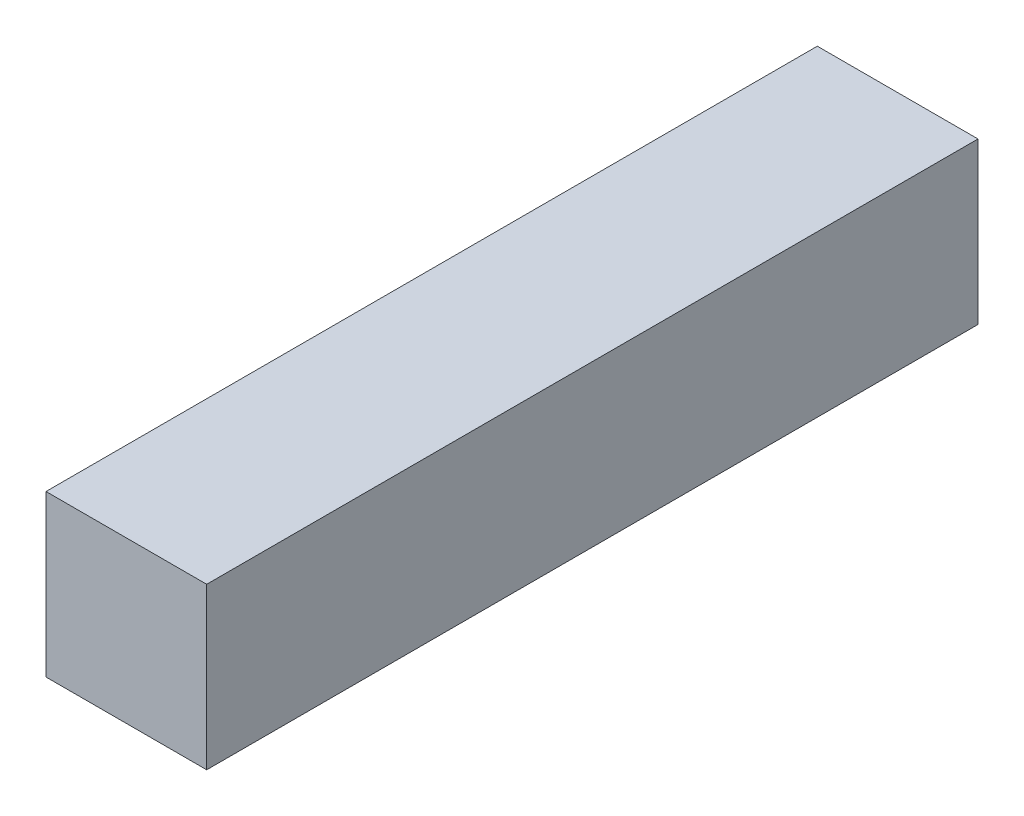
ISO-10303-21;
HEADER;
FILE_DESCRIPTION(('STEP AP214'),'2;1');
FILE_NAME('part.step','',(''),(''),'','','');
FILE_SCHEMA(('AUTOMOTIVE_DESIGN { 1 0 10303 214 1 1 1 1 }'));
ENDSEC;
DATA;
#1=APPLICATION_CONTEXT('core data for automotive mechanical design processes');
#2=APPLICATION_PROTOCOL_DEFINITION('international standard','automotive_design',2000,#1);
#3=PRODUCT_CONTEXT('',#1,'mechanical');
#4=PRODUCT('Part','Part','',(#3));
#5=PRODUCT_RELATED_PRODUCT_CATEGORY('part','',(#4));
#6=PRODUCT_DEFINITION_FORMATION('','',#4);
#7=PRODUCT_DEFINITION_CONTEXT('part definition',#1,'design');
#8=PRODUCT_DEFINITION('design','',#6,#7);
#9=PRODUCT_DEFINITION_SHAPE('','',#8);
#10=(LENGTH_UNIT() NAMED_UNIT(*) SI_UNIT(.MILLI.,.METRE.));
#11=(NAMED_UNIT(*) PLANE_ANGLE_UNIT() SI_UNIT($,.RADIAN.));
#12=(NAMED_UNIT(*) SI_UNIT($,.STERADIAN.) SOLID_ANGLE_UNIT());
#13=UNCERTAINTY_MEASURE_WITH_UNIT(LENGTH_MEASURE(1.E-05),#10,'distance_accuracy_value','');
#14=(GEOMETRIC_REPRESENTATION_CONTEXT(3) GLOBAL_UNCERTAINTY_ASSIGNED_CONTEXT((#13)) GLOBAL_UNIT_ASSIGNED_CONTEXT((#10,
#11,#12)) REPRESENTATION_CONTEXT('',''));
#15=CARTESIAN_POINT('',(0.,0.,0.));
#16=DIRECTION('',(0.,0.,1.));
#17=DIRECTION('',(1.,0.,0.));
#18=AXIS2_PLACEMENT_3D('',#15,#16,#17);
#19=CARTESIAN_POINT('',(1.98437500000003,-40.6796875,304.8));
#20=DIRECTION('',(-1.,0.,0.));
#21=DIRECTION('',(0.,0.,1.));
#22=AXIS2_PLACEMENT_3D('',#19,#20,#21);
#23=PLANE('',#22);
#24=DIRECTION('',(0.,1.,0.));
#25=VECTOR('',#24,1.);
#26=CARTESIAN_POINT('',(1.98437500000003,-40.6796875,0.));
#27=LINE('',#26,#25);
#28=CARTESIAN_POINT('',(1.98437500000003,-40.6796875,0.));
#29=VERTEX_POINT('',#28);
#30=CARTESIAN_POINT('',(1.98437500000003,22.8203125,0.));
#31=VERTEX_POINT('',#30);
#32=EDGE_CURVE('E100',#29,#31,#27,.T.);
#33=ORIENTED_EDGE('',*,*,#32,.T.);
#34=DIRECTION('',(0.,0.,-1.));
#35=VECTOR('',#34,1.);
#36=CARTESIAN_POINT('',(1.98437500000003,22.8203125,304.8));
#37=LINE('',#36,#35);
#38=CARTESIAN_POINT('',(1.98437500000003,22.8203125,304.8));
#39=VERTEX_POINT('',#38);
#40=EDGE_CURVE('E11',#39,#31,#37,.T.);
#41=ORIENTED_EDGE('',*,*,#40,.F.);
#42=DIRECTION('',(0.,1.,0.));
#43=VECTOR('',#42,1.);
#44=CARTESIAN_POINT('',(1.98437500000003,-40.6796875,304.8));
#45=LINE('',#44,#43);
#46=CARTESIAN_POINT('',(1.98437500000003,-40.6796875,304.8));
#47=VERTEX_POINT('',#46);
#48=EDGE_CURVE('E88',#47,#39,#45,.T.);
#49=ORIENTED_EDGE('',*,*,#48,.F.);
#50=DIRECTION('',(0.,0.,-1.));
#51=VECTOR('',#50,1.);
#52=CARTESIAN_POINT('',(1.98437500000003,-40.6796875,304.8));
#53=LINE('',#52,#51);
#54=EDGE_CURVE('E96',#47,#29,#53,.T.);
#55=ORIENTED_EDGE('',*,*,#54,.T.);
#56=EDGE_LOOP('',(#33,#41,#49,#55));
#57=FACE_BOUND('',#56,.T.);
#58=ADVANCED_FACE('F37',(#57),#23,.F.);
#59=CARTESIAN_POINT('',(-61.515625,22.8203125,304.8));
#60=DIRECTION('',(0.,-1.,0.));
#61=DIRECTION('',(0.,0.,-1.));
#62=AXIS2_PLACEMENT_3D('',#59,#60,#61);
#63=PLANE('',#62);
#64=DIRECTION('',(-1.,0.,0.));
#65=VECTOR('',#64,1.);
#66=CARTESIAN_POINT('',(-61.515625,22.8203125,0.));
#67=LINE('',#66,#65);
#68=CARTESIAN_POINT('',(-61.515625,22.8203125,0.));
#69=VERTEX_POINT('',#68);
#70=EDGE_CURVE('E92',#31,#69,#67,.T.);
#71=ORIENTED_EDGE('',*,*,#70,.T.);
#72=DIRECTION('',(0.,0.,-1.));
#73=VECTOR('',#72,1.);
#74=CARTESIAN_POINT('',(-61.515625,22.8203125,304.8));
#75=LINE('',#74,#73);
#76=CARTESIAN_POINT('',(-61.515625,22.8203125,304.8));
#77=VERTEX_POINT('',#76);
#78=EDGE_CURVE('E45',#77,#69,#75,.T.);
#79=ORIENTED_EDGE('',*,*,#78,.F.);
#80=DIRECTION('',(-1.,0.,0.));
#81=VECTOR('',#80,1.);
#82=CARTESIAN_POINT('',(-61.515625,22.8203125,304.8));
#83=LINE('',#82,#81);
#84=EDGE_CURVE('E83',#39,#77,#83,.T.);
#85=ORIENTED_EDGE('',*,*,#84,.F.);
#86=ORIENTED_EDGE('',*,*,#40,.T.);
#87=EDGE_LOOP('',(#71,#79,#85,#86));
#88=FACE_BOUND('',#87,.T.);
#89=ADVANCED_FACE('F91',(#88),#63,.F.);
#90=CARTESIAN_POINT('',(-61.515625,-40.6796875,304.8));
#91=DIRECTION('',(1.,0.,0.));
#92=DIRECTION('',(0.,0.,-1.));
#93=AXIS2_PLACEMENT_3D('',#90,#91,#92);
#94=PLANE('',#93);
#95=DIRECTION('',(0.,-1.,0.));
#96=VECTOR('',#95,1.);
#97=CARTESIAN_POINT('',(-61.515625,-40.6796875,0.));
#98=LINE('',#97,#96);
#99=CARTESIAN_POINT('',(-61.515625,-40.6796875,0.));
#100=VERTEX_POINT('',#99);
#101=EDGE_CURVE('E70',#69,#100,#98,.T.);
#102=ORIENTED_EDGE('',*,*,#101,.T.);
#103=DIRECTION('',(0.,0.,-1.));
#104=VECTOR('',#103,1.);
#105=CARTESIAN_POINT('',(-61.515625,-40.6796875,304.8));
#106=LINE('',#105,#104);
#107=CARTESIAN_POINT('',(-61.515625,-40.6796875,304.8));
#108=VERTEX_POINT('',#107);
#109=EDGE_CURVE('E93',#108,#100,#106,.T.);
#110=ORIENTED_EDGE('',*,*,#109,.F.);
#111=DIRECTION('',(0.,-1.,0.));
#112=VECTOR('',#111,1.);
#113=CARTESIAN_POINT('',(-61.515625,-40.6796875,304.8));
#114=LINE('',#113,#112);
#115=EDGE_CURVE('E86',#77,#108,#114,.T.);
#116=ORIENTED_EDGE('',*,*,#115,.F.);
#117=ORIENTED_EDGE('',*,*,#78,.T.);
#118=EDGE_LOOP('',(#102,#110,#116,#117));
#119=FACE_BOUND('',#118,.T.);
#120=ADVANCED_FACE('F94',(#119),#94,.F.);
#121=CARTESIAN_POINT('',(-61.515625,-40.6796875,304.8));
#122=DIRECTION('',(0.,1.,0.));
#123=DIRECTION('',(0.,0.,1.));
#124=AXIS2_PLACEMENT_3D('',#121,#122,#123);
#125=PLANE('',#124);
#126=DIRECTION('',(1.,0.,0.));
#127=VECTOR('',#126,1.);
#128=CARTESIAN_POINT('',(-61.515625,-40.6796875,0.));
#129=LINE('',#128,#127);
#130=EDGE_CURVE('E76',#100,#29,#129,.T.);
#131=ORIENTED_EDGE('',*,*,#130,.T.);
#132=ORIENTED_EDGE('',*,*,#54,.F.);
#133=DIRECTION('',(1.,0.,0.));
#134=VECTOR('',#133,1.);
#135=CARTESIAN_POINT('',(-61.515625,-40.6796875,304.8));
#136=LINE('',#135,#134);
#137=EDGE_CURVE('E53',#108,#47,#136,.T.);
#138=ORIENTED_EDGE('',*,*,#137,.F.);
#139=ORIENTED_EDGE('',*,*,#109,.T.);
#140=EDGE_LOOP('',(#131,#132,#138,#139));
#141=FACE_BOUND('',#140,.T.);
#142=ADVANCED_FACE('F107',(#141),#125,.F.);
#143=CARTESIAN_POINT('',(0.,0.,304.8));
#144=DIRECTION('',(0.,0.,-1.));
#145=DIRECTION('',(-1.,0.,0.));
#146=AXIS2_PLACEMENT_3D('',#143,#144,#145);
#147=PLANE('',#146);
#148=ORIENTED_EDGE('',*,*,#48,.T.);
#149=ORIENTED_EDGE('',*,*,#84,.T.);
#150=ORIENTED_EDGE('',*,*,#115,.T.);
#151=ORIENTED_EDGE('',*,*,#137,.T.);
#152=EDGE_LOOP('',(#148,#149,#150,#151));
#153=FACE_BOUND('',#152,.T.);
#154=ADVANCED_FACE('F84',(#153),#147,.F.);
#155=CARTESIAN_POINT('',(0.,0.,0.));
#156=DIRECTION('',(0.,0.,-1.));
#157=DIRECTION('',(-1.,0.,0.));
#158=AXIS2_PLACEMENT_3D('',#155,#156,#157);
#159=PLANE('',#158);
#160=ORIENTED_EDGE('',*,*,#32,.F.);
#161=ORIENTED_EDGE('',*,*,#130,.F.);
#162=ORIENTED_EDGE('',*,*,#101,.F.);
#163=ORIENTED_EDGE('',*,*,#70,.F.);
#164=EDGE_LOOP('',(#160,#161,#162,#163));
#165=FACE_BOUND('',#164,.T.);
#166=ADVANCED_FACE('F110',(#165),#159,.T.);
#167=CLOSED_SHELL('',(#58,#89,#120,#142,#154,#166));
#168=MANIFOLD_SOLID_BREP('B2',#167);
#169=ADVANCED_BREP_SHAPE_REPRESENTATION('',(#18,#168),#14);
#170=SHAPE_DEFINITION_REPRESENTATION(#9,#169);
ENDSEC;
END-ISO-10303-21;
